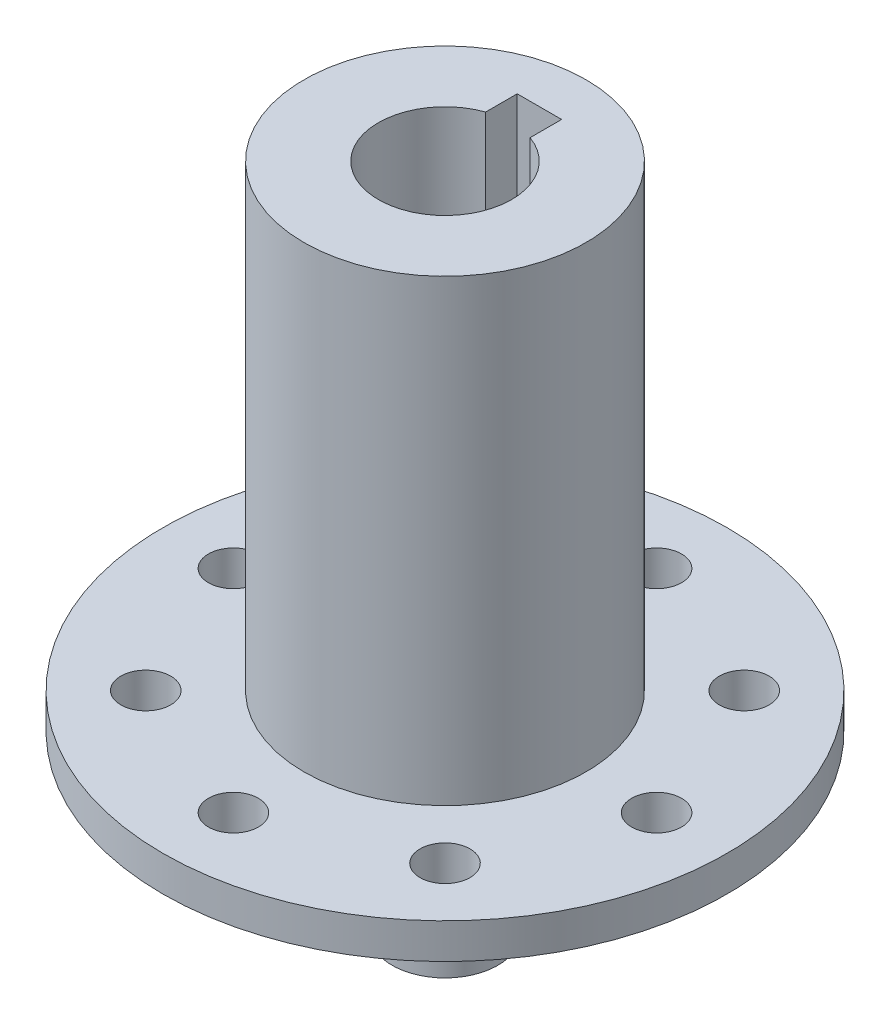
ISO-10303-21;
HEADER;
FILE_DESCRIPTION(('STEP AP214'),'2;1');
FILE_NAME('part.step','',(''),(''),'','','');
FILE_SCHEMA(('AUTOMOTIVE_DESIGN { 1 0 10303 214 1 1 1 1 }'));
ENDSEC;
DATA;
#1=APPLICATION_CONTEXT('core data for automotive mechanical design processes');
#2=APPLICATION_PROTOCOL_DEFINITION('international standard','automotive_design',2000,#1);
#3=PRODUCT_CONTEXT('',#1,'mechanical');
#4=PRODUCT('Part','Part','',(#3));
#5=PRODUCT_RELATED_PRODUCT_CATEGORY('part','',(#4));
#6=PRODUCT_DEFINITION_FORMATION('','',#4);
#7=PRODUCT_DEFINITION_CONTEXT('part definition',#1,'design');
#8=PRODUCT_DEFINITION('design','',#6,#7);
#9=PRODUCT_DEFINITION_SHAPE('','',#8);
#10=(LENGTH_UNIT() NAMED_UNIT(*) SI_UNIT(.MILLI.,.METRE.));
#11=(NAMED_UNIT(*) PLANE_ANGLE_UNIT() SI_UNIT($,.RADIAN.));
#12=(NAMED_UNIT(*) SI_UNIT($,.STERADIAN.) SOLID_ANGLE_UNIT());
#13=UNCERTAINTY_MEASURE_WITH_UNIT(LENGTH_MEASURE(1.E-05),#10,'distance_accuracy_value','');
#14=(GEOMETRIC_REPRESENTATION_CONTEXT(3) GLOBAL_UNCERTAINTY_ASSIGNED_CONTEXT((#13)) GLOBAL_UNIT_ASSIGNED_CONTEXT((#10,
#11,#12)) REPRESENTATION_CONTEXT('',''));
#15=CARTESIAN_POINT('',(0.,0.,0.));
#16=DIRECTION('',(0.,0.,1.));
#17=DIRECTION('',(1.,0.,0.));
#18=AXIS2_PLACEMENT_3D('',#15,#16,#17);
#19=CARTESIAN_POINT('',(0.,41.275,0.));
#20=DIRECTION('',(0.,-1.,0.));
#21=DIRECTION('',(0.,0.,-1.));
#22=AXIS2_PLACEMENT_3D('',#19,#20,#21);
#23=CYLINDRICAL_SURFACE('',#22,12.7);
#24=CARTESIAN_POINT('',(0.,41.275,0.));
#25=DIRECTION('',(0.,1.,0.));
#26=DIRECTION('',(0.,0.,1.));
#27=AXIS2_PLACEMENT_3D('',#24,#25,#26);
#28=CIRCLE('',#27,12.7);
#29=CARTESIAN_POINT('',(0.,41.275,12.7));
#30=VERTEX_POINT('',#29);
#31=EDGE_CURVE('E184',#30,#30,#28,.T.);
#32=ORIENTED_EDGE('',*,*,#31,.F.);
#33=EDGE_LOOP('',(#32));
#34=FACE_BOUND('',#33,.T.);
#35=CARTESIAN_POINT('',(0.,0.,0.));
#36=DIRECTION('',(0.,1.,0.));
#37=DIRECTION('',(0.,0.,1.));
#38=AXIS2_PLACEMENT_3D('',#35,#36,#37);
#39=CIRCLE('',#38,12.7);
#40=CARTESIAN_POINT('',(0.,0.,12.7));
#41=VERTEX_POINT('',#40);
#42=EDGE_CURVE('E179',#41,#41,#39,.T.);
#43=ORIENTED_EDGE('',*,*,#42,.T.);
#44=EDGE_LOOP('',(#43));
#45=FACE_BOUND('',#44,.T.);
#46=ADVANCED_FACE('F39',(#34,#45),#23,.T.);
#47=CARTESIAN_POINT('',(0.,41.275,0.));
#48=DIRECTION('',(0.,1.,0.));
#49=DIRECTION('',(0.,0.,1.));
#50=AXIS2_PLACEMENT_3D('',#47,#48,#49);
#51=PLANE('',#50);
#52=CARTESIAN_POINT('',(0.,41.275,0.));
#53=DIRECTION('',(0.,1.,0.));
#54=DIRECTION('',(0.,0.,1.));
#55=AXIS2_PLACEMENT_3D('',#52,#53,#54);
#56=CIRCLE('',#55,6.);
#57=CARTESIAN_POINT('',(-2.,41.275,-5.65685424949238));
#58=VERTEX_POINT('',#57);
#59=CARTESIAN_POINT('',(2.,41.275,-5.65685424949238));
#60=VERTEX_POINT('',#59);
#61=EDGE_CURVE('E55',#58,#60,#56,.T.);
#62=ORIENTED_EDGE('',*,*,#61,.F.);
#63=DIRECTION('',(0.,0.,1.));
#64=VECTOR('',#63,1.);
#65=CARTESIAN_POINT('',(-2.,41.275,-8.5));
#66=LINE('',#65,#64);
#67=CARTESIAN_POINT('',(-2.,41.275,-8.5));
#68=VERTEX_POINT('',#67);
#69=EDGE_CURVE('E110',#68,#58,#66,.T.);
#70=ORIENTED_EDGE('',*,*,#69,.F.);
#71=DIRECTION('',(-1.,0.,0.));
#72=VECTOR('',#71,1.);
#73=CARTESIAN_POINT('',(-2.,41.275,-8.5));
#74=LINE('',#73,#72);
#75=CARTESIAN_POINT('',(2.,41.275,-8.5));
#76=VERTEX_POINT('',#75);
#77=EDGE_CURVE('E121',#76,#68,#74,.T.);
#78=ORIENTED_EDGE('',*,*,#77,.F.);
#79=DIRECTION('',(0.,0.,-1.));
#80=VECTOR('',#79,1.);
#81=CARTESIAN_POINT('',(2.,41.275,-8.5));
#82=LINE('',#81,#80);
#83=EDGE_CURVE('E90',#60,#76,#82,.T.);
#84=ORIENTED_EDGE('',*,*,#83,.F.);
#85=EDGE_LOOP('',(#62,#70,#78,#84));
#86=FACE_BOUND('',#85,.T.);
#87=ORIENTED_EDGE('',*,*,#31,.T.);
#88=EDGE_LOOP('',(#87));
#89=FACE_BOUND('',#88,.T.);
#90=ADVANCED_FACE('F228',(#86,#89),#51,.T.);
#91=CARTESIAN_POINT('',(0.,-3.175,0.));
#92=DIRECTION('',(0.,1.,0.));
#93=DIRECTION('',(0.,0.,1.));
#94=AXIS2_PLACEMENT_3D('',#91,#92,#93);
#95=CYLINDRICAL_SURFACE('',#94,25.4);
#96=CARTESIAN_POINT('',(0.,-3.175,0.));
#97=DIRECTION('',(0.,-1.,0.));
#98=DIRECTION('',(0.,0.,-1.));
#99=AXIS2_PLACEMENT_3D('',#96,#97,#98);
#100=CIRCLE('',#99,25.4);
#101=CARTESIAN_POINT('',(0.,-3.175,-25.4));
#102=VERTEX_POINT('',#101);
#103=EDGE_CURVE('E175',#102,#102,#100,.T.);
#104=ORIENTED_EDGE('',*,*,#103,.F.);
#105=EDGE_LOOP('',(#104));
#106=FACE_BOUND('',#105,.T.);
#107=CARTESIAN_POINT('',(0.,0.,0.));
#108=DIRECTION('',(0.,-1.,0.));
#109=DIRECTION('',(0.,0.,-1.));
#110=AXIS2_PLACEMENT_3D('',#107,#108,#109);
#111=CIRCLE('',#110,25.4);
#112=CARTESIAN_POINT('',(0.,0.,-25.4));
#113=VERTEX_POINT('',#112);
#114=EDGE_CURVE('E180',#113,#113,#111,.T.);
#115=ORIENTED_EDGE('',*,*,#114,.T.);
#116=EDGE_LOOP('',(#115));
#117=FACE_BOUND('',#116,.T.);
#118=ADVANCED_FACE('F233',(#106,#117),#95,.T.);
#119=CARTESIAN_POINT('',(0.,-3.175,0.));
#120=DIRECTION('',(0.,-1.,0.));
#121=DIRECTION('',(0.,0.,-1.));
#122=AXIS2_PLACEMENT_3D('',#119,#120,#121);
#123=PLANE('',#122);
#124=CARTESIAN_POINT('',(0.,-3.175,0.));
#125=DIRECTION('',(0.,-1.,0.));
#126=DIRECTION('',(0.,0.,-1.));
#127=AXIS2_PLACEMENT_3D('',#124,#125,#126);
#128=CIRCLE('',#127,9.7625);
#129=CARTESIAN_POINT('',(0.,-3.175,-9.7625));
#130=VERTEX_POINT('',#129);
#131=EDGE_CURVE('E11',#130,#130,#128,.F.);
#132=ORIENTED_EDGE('',*,*,#131,.T.);
#133=EDGE_LOOP('',(#132));
#134=FACE_BOUND('',#133,.T.);
#135=CARTESIAN_POINT('',(0.,-3.175,-19.05));
#136=DIRECTION('',(0.,-1.,0.));
#137=DIRECTION('',(0.,0.,-1.));
#138=AXIS2_PLACEMENT_3D('',#135,#136,#137);
#139=CIRCLE('',#138,2.24789999999999);
#140=CARTESIAN_POINT('',(0.,-3.175,-21.2979));
#141=VERTEX_POINT('',#140);
#142=EDGE_CURVE('E128',#141,#141,#139,.T.);
#143=ORIENTED_EDGE('',*,*,#142,.F.);
#144=EDGE_LOOP('',(#143));
#145=FACE_BOUND('',#144,.T.);
#146=CARTESIAN_POINT('',(13.4703841816038,-3.175,-13.4703841816037));
#147=DIRECTION('',(0.,-1.,0.));
#148=DIRECTION('',(0.,0.,-1.));
#149=AXIS2_PLACEMENT_3D('',#146,#147,#148);
#150=CIRCLE('',#149,2.24789999999999);
#151=CARTESIAN_POINT('',(13.4703841816038,-3.175,-15.7182841816037));
#152=VERTEX_POINT('',#151);
#153=EDGE_CURVE('E140',#152,#152,#150,.T.);
#154=ORIENTED_EDGE('',*,*,#153,.F.);
#155=EDGE_LOOP('',(#154));
#156=FACE_BOUND('',#155,.T.);
#157=CARTESIAN_POINT('',(19.05,-3.175,0.));
#158=DIRECTION('',(0.,-1.,0.));
#159=DIRECTION('',(0.,0.,-1.));
#160=AXIS2_PLACEMENT_3D('',#157,#158,#159);
#161=CIRCLE('',#160,2.24789999999999);
#162=CARTESIAN_POINT('',(19.05,-3.175,-2.24789999999999));
#163=VERTEX_POINT('',#162);
#164=EDGE_CURVE('E145',#163,#163,#161,.T.);
#165=ORIENTED_EDGE('',*,*,#164,.F.);
#166=EDGE_LOOP('',(#165));
#167=FACE_BOUND('',#166,.T.);
#168=CARTESIAN_POINT('',(13.4703841816037,-3.175,13.4703841816038));
#169=DIRECTION('',(0.,-1.,0.));
#170=DIRECTION('',(0.,0.,-1.));
#171=AXIS2_PLACEMENT_3D('',#168,#169,#170);
#172=CIRCLE('',#171,2.24789999999999);
#173=CARTESIAN_POINT('',(13.4703841816037,-3.175,11.2224841816038));
#174=VERTEX_POINT('',#173);
#175=EDGE_CURVE('E150',#174,#174,#172,.T.);
#176=ORIENTED_EDGE('',*,*,#175,.F.);
#177=EDGE_LOOP('',(#176));
#178=FACE_BOUND('',#177,.T.);
#179=CARTESIAN_POINT('',(0.,-3.175,19.05));
#180=DIRECTION('',(0.,-1.,0.));
#181=DIRECTION('',(0.,0.,-1.));
#182=AXIS2_PLACEMENT_3D('',#179,#180,#181);
#183=CIRCLE('',#182,2.24789999999999);
#184=CARTESIAN_POINT('',(0.,-3.175,16.8021));
#185=VERTEX_POINT('',#184);
#186=EDGE_CURVE('E155',#185,#185,#183,.T.);
#187=ORIENTED_EDGE('',*,*,#186,.F.);
#188=EDGE_LOOP('',(#187));
#189=FACE_BOUND('',#188,.T.);
#190=CARTESIAN_POINT('',(-13.4703841816038,-3.175,13.4703841816037));
#191=DIRECTION('',(0.,-1.,0.));
#192=DIRECTION('',(0.,0.,-1.));
#193=AXIS2_PLACEMENT_3D('',#190,#191,#192);
#194=CIRCLE('',#193,2.24789999999999);
#195=CARTESIAN_POINT('',(-13.4703841816038,-3.175,11.2224841816037));
#196=VERTEX_POINT('',#195);
#197=EDGE_CURVE('E160',#196,#196,#194,.T.);
#198=ORIENTED_EDGE('',*,*,#197,.F.);
#199=EDGE_LOOP('',(#198));
#200=FACE_BOUND('',#199,.T.);
#201=CARTESIAN_POINT('',(-19.05,-3.175,0.));
#202=DIRECTION('',(0.,-1.,0.));
#203=DIRECTION('',(0.,0.,-1.));
#204=AXIS2_PLACEMENT_3D('',#201,#202,#203);
#205=CIRCLE('',#204,2.24789999999999);
#206=CARTESIAN_POINT('',(-19.05,-3.175,-2.2479));
#207=VERTEX_POINT('',#206);
#208=EDGE_CURVE('E165',#207,#207,#205,.T.);
#209=ORIENTED_EDGE('',*,*,#208,.F.);
#210=EDGE_LOOP('',(#209));
#211=FACE_BOUND('',#210,.T.);
#212=CARTESIAN_POINT('',(-13.4703841816037,-3.175,-13.4703841816037));
#213=DIRECTION('',(0.,-1.,0.));
#214=DIRECTION('',(0.,0.,-1.));
#215=AXIS2_PLACEMENT_3D('',#212,#213,#214);
#216=CIRCLE('',#215,2.24789999999999);
#217=CARTESIAN_POINT('',(-13.4703841816037,-3.175,-15.7182841816037));
#218=VERTEX_POINT('',#217);
#219=EDGE_CURVE('E170',#218,#218,#216,.T.);
#220=ORIENTED_EDGE('',*,*,#219,.F.);
#221=EDGE_LOOP('',(#220));
#222=FACE_BOUND('',#221,.T.);
#223=ORIENTED_EDGE('',*,*,#103,.T.);
#224=EDGE_LOOP('',(#223));
#225=FACE_BOUND('',#224,.T.);
#226=ADVANCED_FACE('F241',(#134,#145,#156,#167,#178,#189,#200,#211,#222,#225),#123,.T.);
#227=CARTESIAN_POINT('',(0.,0.,0.));
#228=DIRECTION('',(0.,-1.,0.));
#229=DIRECTION('',(0.,0.,-1.));
#230=AXIS2_PLACEMENT_3D('',#227,#228,#229);
#231=PLANE('',#230);
#232=CARTESIAN_POINT('',(0.,0.,-19.05));
#233=DIRECTION('',(0.,-1.,0.));
#234=DIRECTION('',(0.,0.,-1.));
#235=AXIS2_PLACEMENT_3D('',#232,#233,#234);
#236=CIRCLE('',#235,2.24789999999999);
#237=CARTESIAN_POINT('',(0.,0.,-21.2979));
#238=VERTEX_POINT('',#237);
#239=EDGE_CURVE('E136',#238,#238,#236,.T.);
#240=ORIENTED_EDGE('',*,*,#239,.T.);
#241=EDGE_LOOP('',(#240));
#242=FACE_BOUND('',#241,.T.);
#243=CARTESIAN_POINT('',(13.4703841816038,0.,-13.4703841816037));
#244=DIRECTION('',(0.,-1.,0.));
#245=DIRECTION('',(0.,0.,-1.));
#246=AXIS2_PLACEMENT_3D('',#243,#244,#245);
#247=CIRCLE('',#246,2.24789999999999);
#248=CARTESIAN_POINT('',(13.4703841816038,0.,-15.7182841816037));
#249=VERTEX_POINT('',#248);
#250=EDGE_CURVE('E144',#249,#249,#247,.T.);
#251=ORIENTED_EDGE('',*,*,#250,.T.);
#252=EDGE_LOOP('',(#251));
#253=FACE_BOUND('',#252,.T.);
#254=CARTESIAN_POINT('',(19.05,0.,0.));
#255=DIRECTION('',(0.,-1.,0.));
#256=DIRECTION('',(0.,0.,-1.));
#257=AXIS2_PLACEMENT_3D('',#254,#255,#256);
#258=CIRCLE('',#257,2.24789999999999);
#259=CARTESIAN_POINT('',(19.05,0.,-2.24789999999999));
#260=VERTEX_POINT('',#259);
#261=EDGE_CURVE('E149',#260,#260,#258,.T.);
#262=ORIENTED_EDGE('',*,*,#261,.T.);
#263=EDGE_LOOP('',(#262));
#264=FACE_BOUND('',#263,.T.);
#265=CARTESIAN_POINT('',(13.4703841816037,0.,13.4703841816038));
#266=DIRECTION('',(0.,-1.,0.));
#267=DIRECTION('',(0.,0.,-1.));
#268=AXIS2_PLACEMENT_3D('',#265,#266,#267);
#269=CIRCLE('',#268,2.24789999999999);
#270=CARTESIAN_POINT('',(13.4703841816037,0.,11.2224841816038));
#271=VERTEX_POINT('',#270);
#272=EDGE_CURVE('E154',#271,#271,#269,.T.);
#273=ORIENTED_EDGE('',*,*,#272,.T.);
#274=EDGE_LOOP('',(#273));
#275=FACE_BOUND('',#274,.T.);
#276=CARTESIAN_POINT('',(0.,0.,19.05));
#277=DIRECTION('',(0.,-1.,0.));
#278=DIRECTION('',(0.,0.,-1.));
#279=AXIS2_PLACEMENT_3D('',#276,#277,#278);
#280=CIRCLE('',#279,2.24789999999999);
#281=CARTESIAN_POINT('',(0.,0.,16.8021));
#282=VERTEX_POINT('',#281);
#283=EDGE_CURVE('E159',#282,#282,#280,.T.);
#284=ORIENTED_EDGE('',*,*,#283,.T.);
#285=EDGE_LOOP('',(#284));
#286=FACE_BOUND('',#285,.T.);
#287=CARTESIAN_POINT('',(-13.4703841816038,0.,13.4703841816037));
#288=DIRECTION('',(0.,-1.,0.));
#289=DIRECTION('',(0.,0.,-1.));
#290=AXIS2_PLACEMENT_3D('',#287,#288,#289);
#291=CIRCLE('',#290,2.24789999999999);
#292=CARTESIAN_POINT('',(-13.4703841816038,0.,11.2224841816037));
#293=VERTEX_POINT('',#292);
#294=EDGE_CURVE('E164',#293,#293,#291,.T.);
#295=ORIENTED_EDGE('',*,*,#294,.T.);
#296=EDGE_LOOP('',(#295));
#297=FACE_BOUND('',#296,.T.);
#298=CARTESIAN_POINT('',(-19.05,0.,0.));
#299=DIRECTION('',(0.,-1.,0.));
#300=DIRECTION('',(0.,0.,-1.));
#301=AXIS2_PLACEMENT_3D('',#298,#299,#300);
#302=CIRCLE('',#301,2.24789999999999);
#303=CARTESIAN_POINT('',(-19.05,0.,-2.2479));
#304=VERTEX_POINT('',#303);
#305=EDGE_CURVE('E169',#304,#304,#302,.T.);
#306=ORIENTED_EDGE('',*,*,#305,.T.);
#307=EDGE_LOOP('',(#306));
#308=FACE_BOUND('',#307,.T.);
#309=CARTESIAN_POINT('',(-13.4703841816037,0.,-13.4703841816037));
#310=DIRECTION('',(0.,-1.,0.));
#311=DIRECTION('',(0.,0.,-1.));
#312=AXIS2_PLACEMENT_3D('',#309,#310,#311);
#313=CIRCLE('',#312,2.24789999999999);
#314=CARTESIAN_POINT('',(-13.4703841816037,0.,-15.7182841816037));
#315=VERTEX_POINT('',#314);
#316=EDGE_CURVE('E174',#315,#315,#313,.T.);
#317=ORIENTED_EDGE('',*,*,#316,.T.);
#318=EDGE_LOOP('',(#317));
#319=FACE_BOUND('',#318,.T.);
#320=ORIENTED_EDGE('',*,*,#42,.F.);
#321=EDGE_LOOP('',(#320));
#322=FACE_BOUND('',#321,.T.);
#323=ORIENTED_EDGE('',*,*,#114,.F.);
#324=EDGE_LOOP('',(#323));
#325=FACE_BOUND('',#324,.T.);
#326=ADVANCED_FACE('F243',(#242,#253,#264,#275,#286,#297,#308,#319,#322,#325),#231,.F.);
#327=CARTESIAN_POINT('',(-13.4703841816037,-3.175,-13.4703841816037));
#328=DIRECTION('',(0.,-1.,0.));
#329=DIRECTION('',(0.,0.,-1.));
#330=AXIS2_PLACEMENT_3D('',#327,#328,#329);
#331=CYLINDRICAL_SURFACE('',#330,2.24789999999999);
#332=ORIENTED_EDGE('',*,*,#219,.T.);
#333=EDGE_LOOP('',(#332));
#334=FACE_BOUND('',#333,.T.);
#335=ORIENTED_EDGE('',*,*,#316,.F.);
#336=EDGE_LOOP('',(#335));
#337=FACE_BOUND('',#336,.T.);
#338=ADVANCED_FACE('F246',(#334,#337),#331,.F.);
#339=CARTESIAN_POINT('',(-19.05,-3.175,0.));
#340=DIRECTION('',(0.,-1.,0.));
#341=DIRECTION('',(0.,0.,-1.));
#342=AXIS2_PLACEMENT_3D('',#339,#340,#341);
#343=CYLINDRICAL_SURFACE('',#342,2.24789999999999);
#344=ORIENTED_EDGE('',*,*,#208,.T.);
#345=EDGE_LOOP('',(#344));
#346=FACE_BOUND('',#345,.T.);
#347=ORIENTED_EDGE('',*,*,#305,.F.);
#348=EDGE_LOOP('',(#347));
#349=FACE_BOUND('',#348,.T.);
#350=ADVANCED_FACE('F253',(#346,#349),#343,.F.);
#351=CARTESIAN_POINT('',(-13.4703841816038,-3.175,13.4703841816037));
#352=DIRECTION('',(0.,-1.,0.));
#353=DIRECTION('',(0.,0.,-1.));
#354=AXIS2_PLACEMENT_3D('',#351,#352,#353);
#355=CYLINDRICAL_SURFACE('',#354,2.24789999999999);
#356=ORIENTED_EDGE('',*,*,#197,.T.);
#357=EDGE_LOOP('',(#356));
#358=FACE_BOUND('',#357,.T.);
#359=ORIENTED_EDGE('',*,*,#294,.F.);
#360=EDGE_LOOP('',(#359));
#361=FACE_BOUND('',#360,.T.);
#362=ADVANCED_FACE('F257',(#358,#361),#355,.F.);
#363=CARTESIAN_POINT('',(0.,-3.175,19.05));
#364=DIRECTION('',(0.,-1.,0.));
#365=DIRECTION('',(0.,0.,-1.));
#366=AXIS2_PLACEMENT_3D('',#363,#364,#365);
#367=CYLINDRICAL_SURFACE('',#366,2.24789999999999);
#368=ORIENTED_EDGE('',*,*,#186,.T.);
#369=EDGE_LOOP('',(#368));
#370=FACE_BOUND('',#369,.T.);
#371=ORIENTED_EDGE('',*,*,#283,.F.);
#372=EDGE_LOOP('',(#371));
#373=FACE_BOUND('',#372,.T.);
#374=ADVANCED_FACE('F261',(#370,#373),#367,.F.);
#375=CARTESIAN_POINT('',(13.4703841816037,-3.175,13.4703841816038));
#376=DIRECTION('',(0.,-1.,0.));
#377=DIRECTION('',(0.,0.,-1.));
#378=AXIS2_PLACEMENT_3D('',#375,#376,#377);
#379=CYLINDRICAL_SURFACE('',#378,2.24789999999999);
#380=ORIENTED_EDGE('',*,*,#175,.T.);
#381=EDGE_LOOP('',(#380));
#382=FACE_BOUND('',#381,.T.);
#383=ORIENTED_EDGE('',*,*,#272,.F.);
#384=EDGE_LOOP('',(#383));
#385=FACE_BOUND('',#384,.T.);
#386=ADVANCED_FACE('F265',(#382,#385),#379,.F.);
#387=CARTESIAN_POINT('',(19.05,-3.175,0.));
#388=DIRECTION('',(0.,-1.,0.));
#389=DIRECTION('',(0.,0.,-1.));
#390=AXIS2_PLACEMENT_3D('',#387,#388,#389);
#391=CYLINDRICAL_SURFACE('',#390,2.24789999999999);
#392=ORIENTED_EDGE('',*,*,#164,.T.);
#393=EDGE_LOOP('',(#392));
#394=FACE_BOUND('',#393,.T.);
#395=ORIENTED_EDGE('',*,*,#261,.F.);
#396=EDGE_LOOP('',(#395));
#397=FACE_BOUND('',#396,.T.);
#398=ADVANCED_FACE('F269',(#394,#397),#391,.F.);
#399=CARTESIAN_POINT('',(13.4703841816038,-3.175,-13.4703841816037));
#400=DIRECTION('',(0.,-1.,0.));
#401=DIRECTION('',(0.,0.,-1.));
#402=AXIS2_PLACEMENT_3D('',#399,#400,#401);
#403=CYLINDRICAL_SURFACE('',#402,2.24789999999999);
#404=ORIENTED_EDGE('',*,*,#153,.T.);
#405=EDGE_LOOP('',(#404));
#406=FACE_BOUND('',#405,.T.);
#407=ORIENTED_EDGE('',*,*,#250,.F.);
#408=EDGE_LOOP('',(#407));
#409=FACE_BOUND('',#408,.T.);
#410=ADVANCED_FACE('F273',(#406,#409),#403,.F.);
#411=CARTESIAN_POINT('',(0.,-3.175,-19.05));
#412=DIRECTION('',(0.,-1.,0.));
#413=DIRECTION('',(0.,0.,-1.));
#414=AXIS2_PLACEMENT_3D('',#411,#412,#413);
#415=CYLINDRICAL_SURFACE('',#414,2.24789999999999);
#416=ORIENTED_EDGE('',*,*,#142,.T.);
#417=EDGE_LOOP('',(#416));
#418=FACE_BOUND('',#417,.T.);
#419=ORIENTED_EDGE('',*,*,#239,.F.);
#420=EDGE_LOOP('',(#419));
#421=FACE_BOUND('',#420,.T.);
#422=ADVANCED_FACE('F277',(#418,#421),#415,.F.);
#423=CARTESIAN_POINT('',(0.,16.275,0.));
#424=DIRECTION('',(0.,1.,0.));
#425=DIRECTION('',(0.,0.,1.));
#426=AXIS2_PLACEMENT_3D('',#423,#424,#425);
#427=CYLINDRICAL_SURFACE('',#426,6.);
#428=ORIENTED_EDGE('',*,*,#61,.T.);
#429=DIRECTION('',(0.,1.,0.));
#430=VECTOR('',#429,1.);
#431=CARTESIAN_POINT('',(2.,16.275,-5.65685424949238));
#432=LINE('',#431,#430);
#433=CARTESIAN_POINT('',(2.,16.275,-5.65685424949238));
#434=VERTEX_POINT('',#433);
#435=EDGE_CURVE('E78',#434,#60,#432,.T.);
#436=ORIENTED_EDGE('',*,*,#435,.F.);
#437=CARTESIAN_POINT('',(0.,16.275,0.));
#438=DIRECTION('',(0.,1.,0.));
#439=DIRECTION('',(0.,0.,1.));
#440=AXIS2_PLACEMENT_3D('',#437,#438,#439);
#441=CIRCLE('',#440,6.);
#442=CARTESIAN_POINT('',(-2.,16.275,-5.65685424949238));
#443=VERTEX_POINT('',#442);
#444=EDGE_CURVE('E106',#443,#434,#441,.T.);
#445=ORIENTED_EDGE('',*,*,#444,.F.);
#446=DIRECTION('',(0.,1.,0.));
#447=VECTOR('',#446,1.);
#448=CARTESIAN_POINT('',(-2.,16.275,-5.65685424949238));
#449=LINE('',#448,#447);
#450=EDGE_CURVE('E63',#443,#58,#449,.T.);
#451=ORIENTED_EDGE('',*,*,#450,.T.);
#452=EDGE_LOOP('',(#428,#436,#445,#451));
#453=FACE_BOUND('',#452,.T.);
#454=ADVANCED_FACE('F281',(#453),#427,.F.);
#455=CARTESIAN_POINT('',(-2.,16.275,-8.5));
#456=DIRECTION('',(-1.,0.,0.));
#457=DIRECTION('',(0.,0.,1.));
#458=AXIS2_PLACEMENT_3D('',#455,#456,#457);
#459=PLANE('',#458);
#460=ORIENTED_EDGE('',*,*,#69,.T.);
#461=ORIENTED_EDGE('',*,*,#450,.F.);
#462=DIRECTION('',(0.,0.,1.));
#463=VECTOR('',#462,1.);
#464=CARTESIAN_POINT('',(-2.,16.275,-8.5));
#465=LINE('',#464,#463);
#466=CARTESIAN_POINT('',(-2.,16.275,-8.5));
#467=VERTEX_POINT('',#466);
#468=EDGE_CURVE('E103',#467,#443,#465,.T.);
#469=ORIENTED_EDGE('',*,*,#468,.F.);
#470=DIRECTION('',(0.,1.,0.));
#471=VECTOR('',#470,1.);
#472=CARTESIAN_POINT('',(-2.,16.275,-8.5));
#473=LINE('',#472,#471);
#474=EDGE_CURVE('E95',#467,#68,#473,.T.);
#475=ORIENTED_EDGE('',*,*,#474,.T.);
#476=EDGE_LOOP('',(#460,#461,#469,#475));
#477=FACE_BOUND('',#476,.T.);
#478=ADVANCED_FACE('F285',(#477),#459,.F.);
#479=CARTESIAN_POINT('',(-2.,16.275,-8.5));
#480=DIRECTION('',(0.,0.,-1.));
#481=DIRECTION('',(-1.,0.,0.));
#482=AXIS2_PLACEMENT_3D('',#479,#480,#481);
#483=PLANE('',#482);
#484=ORIENTED_EDGE('',*,*,#77,.T.);
#485=ORIENTED_EDGE('',*,*,#474,.F.);
#486=DIRECTION('',(-1.,0.,0.));
#487=VECTOR('',#486,1.);
#488=CARTESIAN_POINT('',(-2.,16.275,-8.5));
#489=LINE('',#488,#487);
#490=CARTESIAN_POINT('',(2.,16.275,-8.5));
#491=VERTEX_POINT('',#490);
#492=EDGE_CURVE('E98',#491,#467,#489,.T.);
#493=ORIENTED_EDGE('',*,*,#492,.F.);
#494=DIRECTION('',(0.,1.,0.));
#495=VECTOR('',#494,1.);
#496=CARTESIAN_POINT('',(2.,16.275,-8.5));
#497=LINE('',#496,#495);
#498=EDGE_CURVE('E83',#491,#76,#497,.T.);
#499=ORIENTED_EDGE('',*,*,#498,.T.);
#500=EDGE_LOOP('',(#484,#485,#493,#499));
#501=FACE_BOUND('',#500,.T.);
#502=ADVANCED_FACE('F99',(#501),#483,.F.);
#503=CARTESIAN_POINT('',(2.,16.275,-8.5));
#504=DIRECTION('',(1.,0.,0.));
#505=DIRECTION('',(0.,0.,-1.));
#506=AXIS2_PLACEMENT_3D('',#503,#504,#505);
#507=PLANE('',#506);
#508=ORIENTED_EDGE('',*,*,#83,.T.);
#509=ORIENTED_EDGE('',*,*,#498,.F.);
#510=DIRECTION('',(0.,0.,-1.));
#511=VECTOR('',#510,1.);
#512=CARTESIAN_POINT('',(2.,16.275,-8.5));
#513=LINE('',#512,#511);
#514=EDGE_CURVE('E87',#434,#491,#513,.T.);
#515=ORIENTED_EDGE('',*,*,#514,.F.);
#516=ORIENTED_EDGE('',*,*,#435,.T.);
#517=EDGE_LOOP('',(#508,#509,#515,#516));
#518=FACE_BOUND('',#517,.T.);
#519=ADVANCED_FACE('F85',(#518),#507,.F.);
#520=CARTESIAN_POINT('',(0.,16.275,0.));
#521=DIRECTION('',(0.,1.,0.));
#522=DIRECTION('',(0.,0.,1.));
#523=AXIS2_PLACEMENT_3D('',#520,#521,#522);
#524=PLANE('',#523);
#525=ORIENTED_EDGE('',*,*,#444,.T.);
#526=ORIENTED_EDGE('',*,*,#514,.T.);
#527=ORIENTED_EDGE('',*,*,#492,.T.);
#528=ORIENTED_EDGE('',*,*,#468,.T.);
#529=EDGE_LOOP('',(#525,#526,#527,#528));
#530=FACE_BOUND('',#529,.T.);
#531=ADVANCED_FACE('F105',(#530),#524,.T.);
#532=CARTESIAN_POINT('',(0.,-19.05,0.));
#533=DIRECTION('',(0.,1.,0.));
#534=DIRECTION('',(0.,0.,1.));
#535=AXIS2_PLACEMENT_3D('',#532,#533,#534);
#536=CYLINDRICAL_SURFACE('',#535,4.7625);
#537=CARTESIAN_POINT('',(0.,-8.175,0.));
#538=DIRECTION('',(0.,-1.,0.));
#539=DIRECTION('',(0.,0.,-1.));
#540=AXIS2_PLACEMENT_3D('',#537,#538,#539);
#541=CIRCLE('',#540,4.7625);
#542=CARTESIAN_POINT('',(0.,-8.175,-4.7625));
#543=VERTEX_POINT('',#542);
#544=EDGE_CURVE('E48',#543,#543,#541,.T.);
#545=ORIENTED_EDGE('',*,*,#544,.T.);
#546=EDGE_LOOP('',(#545));
#547=FACE_BOUND('',#546,.T.);
#548=CARTESIAN_POINT('',(0.,-19.05,0.));
#549=DIRECTION('',(0.,-1.,0.));
#550=DIRECTION('',(0.,0.,-1.));
#551=AXIS2_PLACEMENT_3D('',#548,#549,#550);
#552=CIRCLE('',#551,4.7625);
#553=CARTESIAN_POINT('',(0.,-19.05,-4.7625));
#554=VERTEX_POINT('',#553);
#555=EDGE_CURVE('E118',#554,#554,#552,.T.);
#556=ORIENTED_EDGE('',*,*,#555,.F.);
#557=EDGE_LOOP('',(#556));
#558=FACE_BOUND('',#557,.T.);
#559=ADVANCED_FACE('F215',(#547,#558),#536,.T.);
#560=CARTESIAN_POINT('',(0.,-19.05,0.));
#561=DIRECTION('',(0.,-1.,0.));
#562=DIRECTION('',(0.,0.,-1.));
#563=AXIS2_PLACEMENT_3D('',#560,#561,#562);
#564=PLANE('',#563);
#565=ORIENTED_EDGE('',*,*,#555,.T.);
#566=EDGE_LOOP('',(#565));
#567=FACE_BOUND('',#566,.T.);
#568=ADVANCED_FACE('F219',(#567),#564,.T.);
#569=CARTESIAN_POINT('',(0.,-8.175,0.));
#570=DIRECTION('',(0.,-1.,0.));
#571=DIRECTION('',(0.,0.,-1.));
#572=AXIS2_PLACEMENT_3D('',#569,#570,#571);
#573=TOROIDAL_SURFACE('',#572,9.7625,5.);
#574=ORIENTED_EDGE('',*,*,#131,.F.);
#575=EDGE_LOOP('',(#574));
#576=FACE_BOUND('',#575,.T.);
#577=ORIENTED_EDGE('',*,*,#544,.F.);
#578=EDGE_LOOP('',(#577));
#579=FACE_BOUND('',#578,.T.);
#580=ADVANCED_FACE('F41',(#576,#579),#573,.F.);
#581=CLOSED_SHELL('',(#46,#90,#118,#226,#326,#338,#350,#362,#374,#386,#398,#410,#422,#454,#478,
#502,#519,#531,#559,#568,#580));
#582=MANIFOLD_SOLID_BREP('B2',#581);
#583=ADVANCED_BREP_SHAPE_REPRESENTATION('',(#18,#582),#14);
#584=SHAPE_DEFINITION_REPRESENTATION(#9,#583);
ENDSEC;
END-ISO-10303-21;
